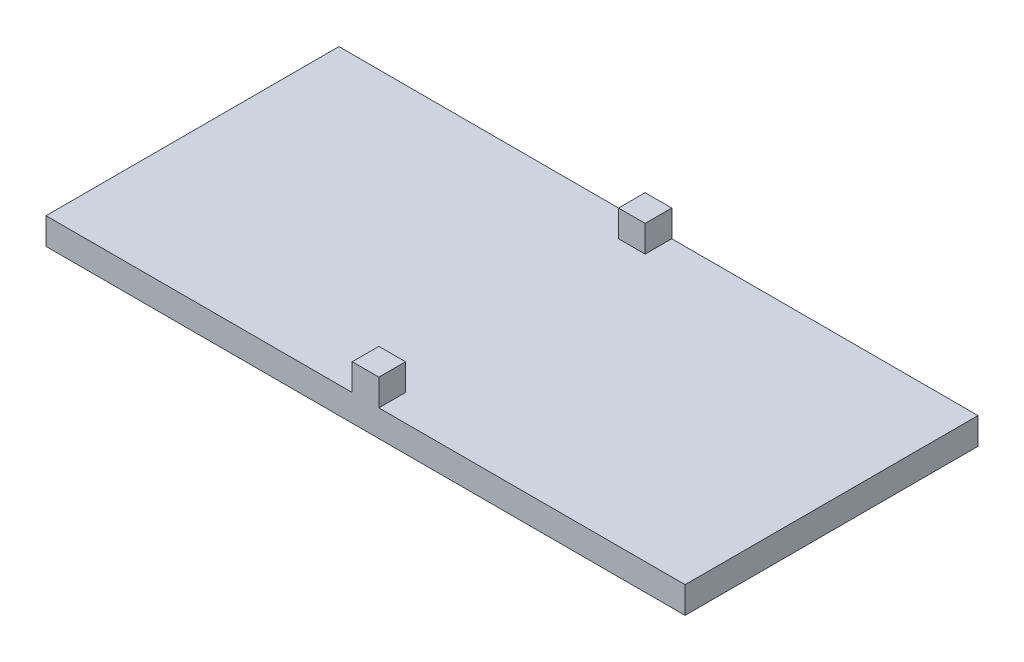
ISO-10303-21;
HEADER;
FILE_DESCRIPTION(('STEP AP214'),'2;1');
FILE_NAME('part.step','',(''),(''),'','','');
FILE_SCHEMA(('AUTOMOTIVE_DESIGN { 1 0 10303 214 1 1 1 1 }'));
ENDSEC;
DATA;
#1=APPLICATION_CONTEXT('core data for automotive mechanical design processes');
#2=APPLICATION_PROTOCOL_DEFINITION('international standard','automotive_design',2000,#1);
#3=PRODUCT_CONTEXT('',#1,'mechanical');
#4=PRODUCT('Part','Part','',(#3));
#5=PRODUCT_RELATED_PRODUCT_CATEGORY('part','',(#4));
#6=PRODUCT_DEFINITION_FORMATION('','',#4);
#7=PRODUCT_DEFINITION_CONTEXT('part definition',#1,'design');
#8=PRODUCT_DEFINITION('design','',#6,#7);
#9=PRODUCT_DEFINITION_SHAPE('','',#8);
#10=(LENGTH_UNIT() NAMED_UNIT(*) SI_UNIT(.MILLI.,.METRE.));
#11=(NAMED_UNIT(*) PLANE_ANGLE_UNIT() SI_UNIT($,.RADIAN.));
#12=(NAMED_UNIT(*) SI_UNIT($,.STERADIAN.) SOLID_ANGLE_UNIT());
#13=UNCERTAINTY_MEASURE_WITH_UNIT(LENGTH_MEASURE(1.E-05),#10,'distance_accuracy_value','');
#14=(GEOMETRIC_REPRESENTATION_CONTEXT(3) GLOBAL_UNCERTAINTY_ASSIGNED_CONTEXT((#13)) GLOBAL_UNIT_ASSIGNED_CONTEXT((#10,
#11,#12)) REPRESENTATION_CONTEXT('',''));
#15=CARTESIAN_POINT('',(0.,0.,0.));
#16=DIRECTION('',(0.,0.,1.));
#17=DIRECTION('',(1.,0.,0.));
#18=AXIS2_PLACEMENT_3D('',#15,#16,#17);
#19=CARTESIAN_POINT('',(0.,10.,0.));
#20=DIRECTION('',(0.,1.,0.));
#21=DIRECTION('',(0.,0.,1.));
#22=AXIS2_PLACEMENT_3D('',#19,#20,#21);
#23=PLANE('',#22);
#24=DIRECTION('',(1.,0.,0.));
#25=VECTOR('',#24,1.);
#26=CARTESIAN_POINT('',(83.6715108937908,10.,-74.610744500846));
#27=LINE('',#26,#25);
#28=CARTESIAN_POINT('',(83.6715108937908,10.,-74.610744500846));
#29=VERTEX_POINT('',#28);
#30=CARTESIAN_POINT('',(93.6715108937908,10.,-74.610744500846));
#31=VERTEX_POINT('',#30);
#32=EDGE_CURVE('E51',#29,#31,#27,.T.);
#33=ORIENTED_EDGE('',*,*,#32,.F.);
#34=DIRECTION('',(0.,0.,1.));
#35=VECTOR('',#34,1.);
#36=CARTESIAN_POINT('',(83.6715108937908,10.,-84.610744500846));
#37=LINE('',#36,#35);
#38=CARTESIAN_POINT('',(83.6715108937908,10.,-84.610744500846));
#39=VERTEX_POINT('',#38);
#40=EDGE_CURVE('E145',#39,#29,#37,.T.);
#41=ORIENTED_EDGE('',*,*,#40,.F.);
#42=DIRECTION('',(-1.,0.,0.));
#43=VECTOR('',#42,1.);
#44=CARTESIAN_POINT('',(-31.3284891062092,10.,-84.610744500846));
#45=LINE('',#44,#43);
#46=CARTESIAN_POINT('',(-31.3284891062092,10.,-84.610744500846));
#47=VERTEX_POINT('',#46);
#48=EDGE_CURVE('E205',#39,#47,#45,.T.);
#49=ORIENTED_EDGE('',*,*,#48,.T.);
#50=DIRECTION('',(0.,0.,1.));
#51=VECTOR('',#50,1.);
#52=CARTESIAN_POINT('',(-31.3284891062092,10.,-84.610744500846));
#53=LINE('',#52,#51);
#54=CARTESIAN_POINT('',(-31.3284891062092,10.,25.389255499154));
#55=VERTEX_POINT('',#54);
#56=EDGE_CURVE('E173',#47,#55,#53,.T.);
#57=ORIENTED_EDGE('',*,*,#56,.T.);
#58=DIRECTION('',(1.,0.,0.));
#59=VECTOR('',#58,1.);
#60=CARTESIAN_POINT('',(-31.3284891062092,10.,25.389255499154));
#61=LINE('',#60,#59);
#62=CARTESIAN_POINT('',(83.6715108937909,10.,25.389255499154));
#63=VERTEX_POINT('',#62);
#64=EDGE_CURVE('E186',#55,#63,#61,.T.);
#65=ORIENTED_EDGE('',*,*,#64,.T.);
#66=DIRECTION('',(0.,0.,1.));
#67=VECTOR('',#66,1.);
#68=CARTESIAN_POINT('',(83.6715108937909,10.,25.389255499154));
#69=LINE('',#68,#67);
#70=CARTESIAN_POINT('',(83.6715108937908,10.,15.389255499154));
#71=VERTEX_POINT('',#70);
#72=EDGE_CURVE('E37',#71,#63,#69,.T.);
#73=ORIENTED_EDGE('',*,*,#72,.F.);
#74=DIRECTION('',(-1.,0.,0.));
#75=VECTOR('',#74,1.);
#76=CARTESIAN_POINT('',(83.6715108937908,10.,15.389255499154));
#77=LINE('',#76,#75);
#78=CARTESIAN_POINT('',(93.6715108937909,10.,15.389255499154));
#79=VERTEX_POINT('',#78);
#80=EDGE_CURVE('E157',#79,#71,#77,.T.);
#81=ORIENTED_EDGE('',*,*,#80,.F.);
#82=DIRECTION('',(0.,0.,-1.));
#83=VECTOR('',#82,1.);
#84=CARTESIAN_POINT('',(93.6715108937908,10.,25.389255499154));
#85=LINE('',#84,#83);
#86=CARTESIAN_POINT('',(93.6715108937908,10.,25.389255499154));
#87=VERTEX_POINT('',#86);
#88=EDGE_CURVE('E148',#87,#79,#85,.T.);
#89=ORIENTED_EDGE('',*,*,#88,.F.);
#90=CARTESIAN_POINT('',(208.671510893791,10.,25.389255499154));
#91=VERTEX_POINT('',#90);
#92=EDGE_CURVE('E176',#87,#91,#61,.T.);
#93=ORIENTED_EDGE('',*,*,#92,.T.);
#94=DIRECTION('',(0.,0.,-1.));
#95=VECTOR('',#94,1.);
#96=CARTESIAN_POINT('',(208.671510893791,10.,-84.610744500846));
#97=LINE('',#96,#95);
#98=CARTESIAN_POINT('',(208.671510893791,10.,-84.610744500846));
#99=VERTEX_POINT('',#98);
#100=EDGE_CURVE('E180',#91,#99,#97,.T.);
#101=ORIENTED_EDGE('',*,*,#100,.T.);
#102=CARTESIAN_POINT('',(93.6715108937908,10.,-84.610744500846));
#103=VERTEX_POINT('',#102);
#104=EDGE_CURVE('E196',#99,#103,#45,.T.);
#105=ORIENTED_EDGE('',*,*,#104,.T.);
#106=DIRECTION('',(0.,0.,-1.));
#107=VECTOR('',#106,1.);
#108=CARTESIAN_POINT('',(93.6715108937908,10.,-84.610744500846));
#109=LINE('',#108,#107);
#110=EDGE_CURVE('E56',#31,#103,#109,.T.);
#111=ORIENTED_EDGE('',*,*,#110,.F.);
#112=EDGE_LOOP('',(#33,#41,#49,#57,#65,#73,#81,#89,#93,#101,#105,#111));
#113=FACE_BOUND('',#112,.T.);
#114=ADVANCED_FACE('F33',(#113),#23,.T.);
#115=CARTESIAN_POINT('',(-31.3284891062092,10.,-84.610744500846));
#116=DIRECTION('',(1.,0.,0.));
#117=DIRECTION('',(0.,0.,-1.));
#118=AXIS2_PLACEMENT_3D('',#115,#116,#117);
#119=PLANE('',#118);
#120=DIRECTION('',(0.,0.,1.));
#121=VECTOR('',#120,1.);
#122=CARTESIAN_POINT('',(-31.3284891062092,0.,-84.610744500846));
#123=LINE('',#122,#121);
#124=CARTESIAN_POINT('',(-31.3284891062092,0.,-84.610744500846));
#125=VERTEX_POINT('',#124);
#126=CARTESIAN_POINT('',(-31.3284891062092,0.,25.389255499154));
#127=VERTEX_POINT('',#126);
#128=EDGE_CURVE('E202',#125,#127,#123,.T.);
#129=ORIENTED_EDGE('',*,*,#128,.T.);
#130=DIRECTION('',(0.,-1.,0.));
#131=VECTOR('',#130,1.);
#132=CARTESIAN_POINT('',(-31.3284891062092,10.,25.389255499154));
#133=LINE('',#132,#131);
#134=EDGE_CURVE('E11',#55,#127,#133,.T.);
#135=ORIENTED_EDGE('',*,*,#134,.F.);
#136=ORIENTED_EDGE('',*,*,#56,.F.);
#137=DIRECTION('',(0.,-1.,0.));
#138=VECTOR('',#137,1.);
#139=CARTESIAN_POINT('',(-31.3284891062092,10.,-84.610744500846));
#140=LINE('',#139,#138);
#141=EDGE_CURVE('E193',#47,#125,#140,.T.);
#142=ORIENTED_EDGE('',*,*,#141,.T.);
#143=EDGE_LOOP('',(#129,#135,#136,#142));
#144=FACE_BOUND('',#143,.T.);
#145=ADVANCED_FACE('F35',(#144),#119,.F.);
#146=CARTESIAN_POINT('',(-31.3284891062092,10.,25.389255499154));
#147=DIRECTION('',(0.,0.,-1.));
#148=DIRECTION('',(-1.,0.,0.));
#149=AXIS2_PLACEMENT_3D('',#146,#147,#148);
#150=PLANE('',#149);
#151=DIRECTION('',(1.,0.,0.));
#152=VECTOR('',#151,1.);
#153=CARTESIAN_POINT('',(-31.3284891062092,0.,25.389255499154));
#154=LINE('',#153,#152);
#155=CARTESIAN_POINT('',(208.671510893791,0.,25.389255499154));
#156=VERTEX_POINT('',#155);
#157=EDGE_CURVE('E200',#127,#156,#154,.T.);
#158=ORIENTED_EDGE('',*,*,#157,.T.);
#159=DIRECTION('',(0.,-1.,0.));
#160=VECTOR('',#159,1.);
#161=CARTESIAN_POINT('',(208.671510893791,10.,25.389255499154));
#162=LINE('',#161,#160);
#163=EDGE_CURVE('E43',#91,#156,#162,.T.);
#164=ORIENTED_EDGE('',*,*,#163,.F.);
#165=ORIENTED_EDGE('',*,*,#92,.F.);
#166=DIRECTION('',(0.,-1.,0.));
#167=VECTOR('',#166,1.);
#168=CARTESIAN_POINT('',(93.6715108937908,20.,25.389255499154));
#169=LINE('',#168,#167);
#170=CARTESIAN_POINT('',(93.6715108937908,20.,25.389255499154));
#171=VERTEX_POINT('',#170);
#172=EDGE_CURVE('E172',#171,#87,#169,.T.);
#173=ORIENTED_EDGE('',*,*,#172,.F.);
#174=DIRECTION('',(1.,0.,0.));
#175=VECTOR('',#174,1.);
#176=CARTESIAN_POINT('',(83.6715108937909,20.,25.389255499154));
#177=LINE('',#176,#175);
#178=CARTESIAN_POINT('',(83.6715108937909,20.,25.389255499154));
#179=VERTEX_POINT('',#178);
#180=EDGE_CURVE('E156',#179,#171,#177,.T.);
#181=ORIENTED_EDGE('',*,*,#180,.F.);
#182=DIRECTION('',(0.,-1.,0.));
#183=VECTOR('',#182,1.);
#184=CARTESIAN_POINT('',(83.6715108937909,20.,25.389255499154));
#185=LINE('',#184,#183);
#186=EDGE_CURVE('E204',#179,#63,#185,.T.);
#187=ORIENTED_EDGE('',*,*,#186,.T.);
#188=ORIENTED_EDGE('',*,*,#64,.F.);
#189=ORIENTED_EDGE('',*,*,#134,.T.);
#190=EDGE_LOOP('',(#158,#164,#165,#173,#181,#187,#188,#189));
#191=FACE_BOUND('',#190,.T.);
#192=ADVANCED_FACE('F242',(#191),#150,.F.);
#193=CARTESIAN_POINT('',(208.671510893791,10.,-84.610744500846));
#194=DIRECTION('',(-1.,0.,0.));
#195=DIRECTION('',(0.,0.,1.));
#196=AXIS2_PLACEMENT_3D('',#193,#194,#195);
#197=PLANE('',#196);
#198=DIRECTION('',(0.,0.,-1.));
#199=VECTOR('',#198,1.);
#200=CARTESIAN_POINT('',(208.671510893791,0.,-84.610744500846));
#201=LINE('',#200,#199);
#202=CARTESIAN_POINT('',(208.671510893791,0.,-84.610744500846));
#203=VERTEX_POINT('',#202);
#204=EDGE_CURVE('E198',#156,#203,#201,.T.);
#205=ORIENTED_EDGE('',*,*,#204,.T.);
#206=DIRECTION('',(0.,-1.,0.));
#207=VECTOR('',#206,1.);
#208=CARTESIAN_POINT('',(208.671510893791,10.,-84.610744500846));
#209=LINE('',#208,#207);
#210=EDGE_CURVE('E190',#99,#203,#209,.T.);
#211=ORIENTED_EDGE('',*,*,#210,.F.);
#212=ORIENTED_EDGE('',*,*,#100,.F.);
#213=ORIENTED_EDGE('',*,*,#163,.T.);
#214=EDGE_LOOP('',(#205,#211,#212,#213));
#215=FACE_BOUND('',#214,.T.);
#216=ADVANCED_FACE('F213',(#215),#197,.F.);
#217=CARTESIAN_POINT('',(-31.3284891062092,10.,-84.610744500846));
#218=DIRECTION('',(0.,0.,1.));
#219=DIRECTION('',(1.,0.,0.));
#220=AXIS2_PLACEMENT_3D('',#217,#218,#219);
#221=PLANE('',#220);
#222=DIRECTION('',(-1.,0.,0.));
#223=VECTOR('',#222,1.);
#224=CARTESIAN_POINT('',(-31.3284891062092,0.,-84.610744500846));
#225=LINE('',#224,#223);
#226=EDGE_CURVE('E177',#203,#125,#225,.T.);
#227=ORIENTED_EDGE('',*,*,#226,.T.);
#228=ORIENTED_EDGE('',*,*,#141,.F.);
#229=ORIENTED_EDGE('',*,*,#48,.F.);
#230=DIRECTION('',(0.,-1.,0.));
#231=VECTOR('',#230,1.);
#232=CARTESIAN_POINT('',(83.6715108937908,20.,-84.610744500846));
#233=LINE('',#232,#231);
#234=CARTESIAN_POINT('',(83.6715108937908,20.,-84.610744500846));
#235=VERTEX_POINT('',#234);
#236=EDGE_CURVE('E221',#235,#39,#233,.T.);
#237=ORIENTED_EDGE('',*,*,#236,.F.);
#238=DIRECTION('',(-1.,0.,0.));
#239=VECTOR('',#238,1.);
#240=CARTESIAN_POINT('',(83.6715108937908,20.,-84.610744500846));
#241=LINE('',#240,#239);
#242=CARTESIAN_POINT('',(93.6715108937908,20.,-84.610744500846));
#243=VERTEX_POINT('',#242);
#244=EDGE_CURVE('E139',#243,#235,#241,.T.);
#245=ORIENTED_EDGE('',*,*,#244,.F.);
#246=DIRECTION('',(0.,-1.,0.));
#247=VECTOR('',#246,1.);
#248=CARTESIAN_POINT('',(93.6715108937908,20.,-84.610744500846));
#249=LINE('',#248,#247);
#250=EDGE_CURVE('E149',#243,#103,#249,.T.);
#251=ORIENTED_EDGE('',*,*,#250,.T.);
#252=ORIENTED_EDGE('',*,*,#104,.F.);
#253=ORIENTED_EDGE('',*,*,#210,.T.);
#254=EDGE_LOOP('',(#227,#228,#229,#237,#245,#251,#252,#253));
#255=FACE_BOUND('',#254,.T.);
#256=ADVANCED_FACE('F218',(#255),#221,.F.);
#257=CARTESIAN_POINT('',(0.,0.,0.));
#258=DIRECTION('',(0.,1.,0.));
#259=DIRECTION('',(0.,0.,1.));
#260=AXIS2_PLACEMENT_3D('',#257,#258,#259);
#261=PLANE('',#260);
#262=ORIENTED_EDGE('',*,*,#128,.F.);
#263=ORIENTED_EDGE('',*,*,#226,.F.);
#264=ORIENTED_EDGE('',*,*,#204,.F.);
#265=ORIENTED_EDGE('',*,*,#157,.F.);
#266=EDGE_LOOP('',(#262,#263,#264,#265));
#267=FACE_BOUND('',#266,.T.);
#268=ADVANCED_FACE('F248',(#267),#261,.F.);
#269=CARTESIAN_POINT('',(83.6715108937909,20.,25.389255499154));
#270=DIRECTION('',(1.,0.,0.));
#271=DIRECTION('',(0.,0.,-1.));
#272=AXIS2_PLACEMENT_3D('',#269,#270,#271);
#273=PLANE('',#272);
#274=ORIENTED_EDGE('',*,*,#72,.T.);
#275=ORIENTED_EDGE('',*,*,#186,.F.);
#276=DIRECTION('',(0.,0.,1.));
#277=VECTOR('',#276,1.);
#278=CARTESIAN_POINT('',(83.6715108937909,20.,25.389255499154));
#279=LINE('',#278,#277);
#280=CARTESIAN_POINT('',(83.6715108937908,20.,15.389255499154));
#281=VERTEX_POINT('',#280);
#282=EDGE_CURVE('E153',#281,#179,#279,.T.);
#283=ORIENTED_EDGE('',*,*,#282,.F.);
#284=DIRECTION('',(0.,-1.,0.));
#285=VECTOR('',#284,1.);
#286=CARTESIAN_POINT('',(83.6715108937908,20.,15.389255499154));
#287=LINE('',#286,#285);
#288=EDGE_CURVE('E162',#281,#71,#287,.T.);
#289=ORIENTED_EDGE('',*,*,#288,.T.);
#290=EDGE_LOOP('',(#274,#275,#283,#289));
#291=FACE_BOUND('',#290,.T.);
#292=ADVANCED_FACE('F246',(#291),#273,.F.);
#293=CARTESIAN_POINT('',(93.6715108937908,20.,25.389255499154));
#294=DIRECTION('',(-1.,0.,0.));
#295=DIRECTION('',(0.,0.,1.));
#296=AXIS2_PLACEMENT_3D('',#293,#294,#295);
#297=PLANE('',#296);
#298=ORIENTED_EDGE('',*,*,#88,.T.);
#299=DIRECTION('',(0.,-1.,0.));
#300=VECTOR('',#299,1.);
#301=CARTESIAN_POINT('',(93.6715108937909,20.,15.389255499154));
#302=LINE('',#301,#300);
#303=CARTESIAN_POINT('',(93.6715108937909,20.,15.389255499154));
#304=VERTEX_POINT('',#303);
#305=EDGE_CURVE('E169',#304,#79,#302,.T.);
#306=ORIENTED_EDGE('',*,*,#305,.F.);
#307=DIRECTION('',(0.,0.,-1.));
#308=VECTOR('',#307,1.);
#309=CARTESIAN_POINT('',(93.6715108937908,20.,25.389255499154));
#310=LINE('',#309,#308);
#311=EDGE_CURVE('E159',#171,#304,#310,.T.);
#312=ORIENTED_EDGE('',*,*,#311,.F.);
#313=ORIENTED_EDGE('',*,*,#172,.T.);
#314=EDGE_LOOP('',(#298,#306,#312,#313));
#315=FACE_BOUND('',#314,.T.);
#316=ADVANCED_FACE('F276',(#315),#297,.F.);
#317=CARTESIAN_POINT('',(83.6715108937908,20.,15.389255499154));
#318=DIRECTION('',(0.,0.,1.));
#319=DIRECTION('',(1.,0.,0.));
#320=AXIS2_PLACEMENT_3D('',#317,#318,#319);
#321=PLANE('',#320);
#322=ORIENTED_EDGE('',*,*,#80,.T.);
#323=ORIENTED_EDGE('',*,*,#288,.F.);
#324=DIRECTION('',(-1.,0.,0.));
#325=VECTOR('',#324,1.);
#326=CARTESIAN_POINT('',(83.6715108937908,20.,15.389255499154));
#327=LINE('',#326,#325);
#328=EDGE_CURVE('E161',#304,#281,#327,.T.);
#329=ORIENTED_EDGE('',*,*,#328,.F.);
#330=ORIENTED_EDGE('',*,*,#305,.T.);
#331=EDGE_LOOP('',(#322,#323,#329,#330));
#332=FACE_BOUND('',#331,.T.);
#333=ADVANCED_FACE('F271',(#332),#321,.F.);
#334=CARTESIAN_POINT('',(0.,20.,0.));
#335=DIRECTION('',(0.,-1.,0.));
#336=DIRECTION('',(0.,0.,-1.));
#337=AXIS2_PLACEMENT_3D('',#334,#335,#336);
#338=PLANE('',#337);
#339=ORIENTED_EDGE('',*,*,#282,.T.);
#340=ORIENTED_EDGE('',*,*,#180,.T.);
#341=ORIENTED_EDGE('',*,*,#311,.T.);
#342=ORIENTED_EDGE('',*,*,#328,.T.);
#343=EDGE_LOOP('',(#339,#340,#341,#342));
#344=FACE_BOUND('',#343,.T.);
#345=ADVANCED_FACE('F285',(#344),#338,.F.);
#346=CARTESIAN_POINT('',(83.6715108937908,20.,-84.610744500846));
#347=DIRECTION('',(1.,0.,0.));
#348=DIRECTION('',(0.,0.,-1.));
#349=AXIS2_PLACEMENT_3D('',#346,#347,#348);
#350=PLANE('',#349);
#351=ORIENTED_EDGE('',*,*,#40,.T.);
#352=DIRECTION('',(0.,-1.,0.));
#353=VECTOR('',#352,1.);
#354=CARTESIAN_POINT('',(83.6715108937908,20.,-74.610744500846));
#355=LINE('',#354,#353);
#356=CARTESIAN_POINT('',(83.6715108937908,20.,-74.610744500846));
#357=VERTEX_POINT('',#356);
#358=EDGE_CURVE('E127',#357,#29,#355,.T.);
#359=ORIENTED_EDGE('',*,*,#358,.F.);
#360=DIRECTION('',(0.,0.,1.));
#361=VECTOR('',#360,1.);
#362=CARTESIAN_POINT('',(83.6715108937908,20.,-84.610744500846));
#363=LINE('',#362,#361);
#364=EDGE_CURVE('E134',#235,#357,#363,.T.);
#365=ORIENTED_EDGE('',*,*,#364,.F.);
#366=ORIENTED_EDGE('',*,*,#236,.T.);
#367=EDGE_LOOP('',(#351,#359,#365,#366));
#368=FACE_BOUND('',#367,.T.);
#369=ADVANCED_FACE('F144',(#368),#350,.F.);
#370=CARTESIAN_POINT('',(83.6715108937908,20.,-74.610744500846));
#371=DIRECTION('',(0.,0.,-1.));
#372=DIRECTION('',(-1.,0.,0.));
#373=AXIS2_PLACEMENT_3D('',#370,#371,#372);
#374=PLANE('',#373);
#375=ORIENTED_EDGE('',*,*,#32,.T.);
#376=DIRECTION('',(0.,-1.,0.));
#377=VECTOR('',#376,1.);
#378=CARTESIAN_POINT('',(93.6715108937908,20.,-74.610744500846));
#379=LINE('',#378,#377);
#380=CARTESIAN_POINT('',(93.6715108937908,20.,-74.610744500846));
#381=VERTEX_POINT('',#380);
#382=EDGE_CURVE('E130',#381,#31,#379,.T.);
#383=ORIENTED_EDGE('',*,*,#382,.F.);
#384=DIRECTION('',(1.,0.,0.));
#385=VECTOR('',#384,1.);
#386=CARTESIAN_POINT('',(83.6715108937908,20.,-74.610744500846));
#387=LINE('',#386,#385);
#388=EDGE_CURVE('E123',#357,#381,#387,.T.);
#389=ORIENTED_EDGE('',*,*,#388,.F.);
#390=ORIENTED_EDGE('',*,*,#358,.T.);
#391=EDGE_LOOP('',(#375,#383,#389,#390));
#392=FACE_BOUND('',#391,.T.);
#393=ADVANCED_FACE('F125',(#392),#374,.F.);
#394=CARTESIAN_POINT('',(93.6715108937908,20.,-84.610744500846));
#395=DIRECTION('',(-1.,0.,0.));
#396=DIRECTION('',(0.,0.,1.));
#397=AXIS2_PLACEMENT_3D('',#394,#395,#396);
#398=PLANE('',#397);
#399=ORIENTED_EDGE('',*,*,#110,.T.);
#400=ORIENTED_EDGE('',*,*,#250,.F.);
#401=DIRECTION('',(0.,0.,-1.));
#402=VECTOR('',#401,1.);
#403=CARTESIAN_POINT('',(93.6715108937908,20.,-84.610744500846));
#404=LINE('',#403,#402);
#405=EDGE_CURVE('E133',#381,#243,#404,.T.);
#406=ORIENTED_EDGE('',*,*,#405,.F.);
#407=ORIENTED_EDGE('',*,*,#382,.T.);
#408=EDGE_LOOP('',(#399,#400,#406,#407));
#409=FACE_BOUND('',#408,.T.);
#410=ADVANCED_FACE('F228',(#409),#398,.F.);
#411=CARTESIAN_POINT('',(0.,20.,0.));
#412=DIRECTION('',(0.,1.,0.));
#413=DIRECTION('',(0.,0.,1.));
#414=AXIS2_PLACEMENT_3D('',#411,#412,#413);
#415=PLANE('',#414);
#416=ORIENTED_EDGE('',*,*,#364,.T.);
#417=ORIENTED_EDGE('',*,*,#388,.T.);
#418=ORIENTED_EDGE('',*,*,#405,.T.);
#419=ORIENTED_EDGE('',*,*,#244,.T.);
#420=EDGE_LOOP('',(#416,#417,#418,#419));
#421=FACE_BOUND('',#420,.T.);
#422=ADVANCED_FACE('F137',(#421),#415,.T.);
#423=CLOSED_SHELL('',(#114,#145,#192,#216,#256,#268,#292,#316,#333,#345,#369,#393,#410,#422));
#424=MANIFOLD_SOLID_BREP('B2',#423);
#425=ADVANCED_BREP_SHAPE_REPRESENTATION('',(#18,#424),#14);
#426=SHAPE_DEFINITION_REPRESENTATION(#9,#425);
ENDSEC;
END-ISO-10303-21;
